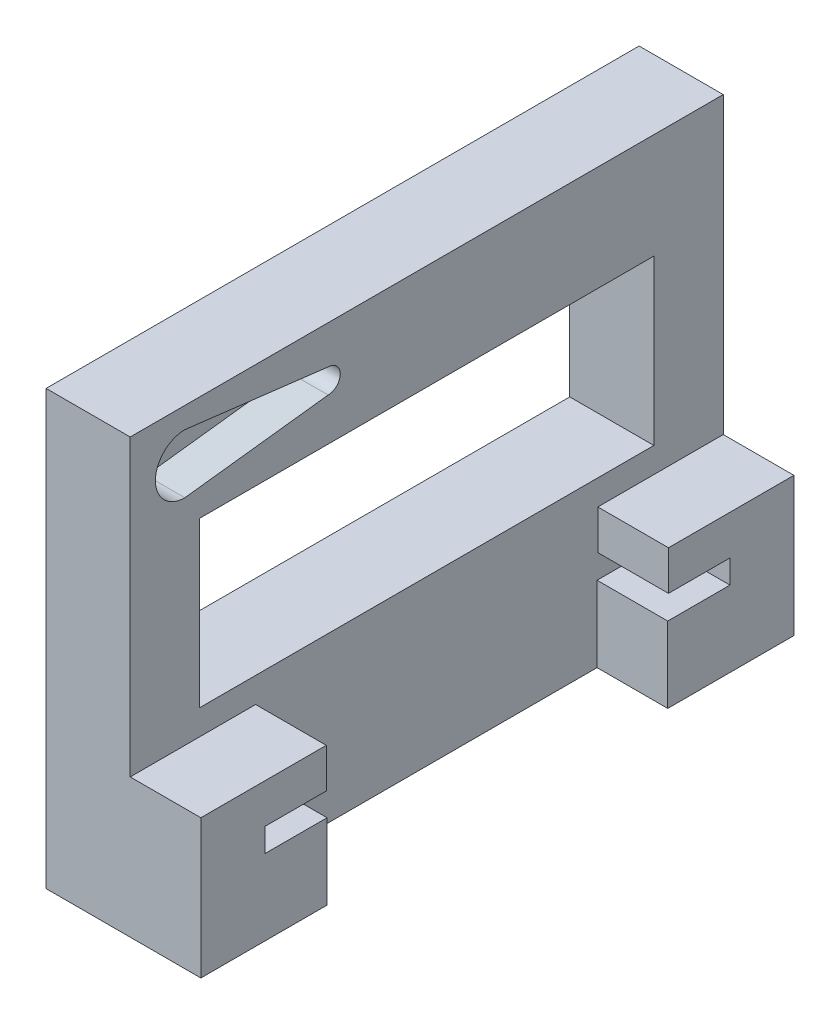
ISO-10303-21;
HEADER;
FILE_DESCRIPTION(('STEP AP214'),'2;1');
FILE_NAME('part.step','',(''),(''),'','','');
FILE_SCHEMA(('AUTOMOTIVE_DESIGN { 1 0 10303 214 1 1 1 1 }'));
ENDSEC;
DATA;
#1=APPLICATION_CONTEXT('core data for automotive mechanical design processes');
#2=APPLICATION_PROTOCOL_DEFINITION('international standard','automotive_design',2000,#1);
#3=PRODUCT_CONTEXT('',#1,'mechanical');
#4=PRODUCT('Part','Part','',(#3));
#5=PRODUCT_RELATED_PRODUCT_CATEGORY('part','',(#4));
#6=PRODUCT_DEFINITION_FORMATION('','',#4);
#7=PRODUCT_DEFINITION_CONTEXT('part definition',#1,'design');
#8=PRODUCT_DEFINITION('design','',#6,#7);
#9=PRODUCT_DEFINITION_SHAPE('','',#8);
#10=(LENGTH_UNIT() NAMED_UNIT(*) SI_UNIT(.MILLI.,.METRE.));
#11=(NAMED_UNIT(*) PLANE_ANGLE_UNIT() SI_UNIT($,.RADIAN.));
#12=(NAMED_UNIT(*) SI_UNIT($,.STERADIAN.) SOLID_ANGLE_UNIT());
#13=UNCERTAINTY_MEASURE_WITH_UNIT(LENGTH_MEASURE(1.E-05),#10,'distance_accuracy_value','');
#14=(GEOMETRIC_REPRESENTATION_CONTEXT(3) GLOBAL_UNCERTAINTY_ASSIGNED_CONTEXT((#13)) GLOBAL_UNIT_ASSIGNED_CONTEXT((#10,
#11,#12)) REPRESENTATION_CONTEXT('',''));
#15=CARTESIAN_POINT('',(0.,0.,0.));
#16=DIRECTION('',(0.,0.,1.));
#17=DIRECTION('',(1.,0.,0.));
#18=AXIS2_PLACEMENT_3D('',#15,#16,#17);
#19=CARTESIAN_POINT('',(8.4,9.,0.));
#20=DIRECTION('',(1.,0.,0.));
#21=DIRECTION('',(0.,0.,-1.));
#22=AXIS2_PLACEMENT_3D('',#19,#20,#21);
#23=PLANE('',#22);
#24=DIRECTION('',(0.,0.,-1.));
#25=VECTOR('',#24,1.);
#26=CARTESIAN_POINT('',(8.4,16.5,15.));
#27=LINE('',#26,#25);
#28=CARTESIAN_POINT('',(8.4,16.5,15.));
#29=VERTEX_POINT('',#28);
#30=CARTESIAN_POINT('',(8.4,16.5,0.0899999999999981));
#31=VERTEX_POINT('',#30);
#32=EDGE_CURVE('E317',#29,#31,#27,.T.);
#33=ORIENTED_EDGE('',*,*,#32,.F.);
#34=DIRECTION('',(0.,-1.,0.));
#35=VECTOR('',#34,1.);
#36=CARTESIAN_POINT('',(8.4,9.,15.));
#37=LINE('',#36,#35);
#38=CARTESIAN_POINT('',(8.4,0.,15.));
#39=VERTEX_POINT('',#38);
#40=EDGE_CURVE('E470',#29,#39,#37,.T.);
#41=ORIENTED_EDGE('',*,*,#40,.T.);
#42=DIRECTION('',(0.,0.,1.));
#43=VECTOR('',#42,1.);
#44=CARTESIAN_POINT('',(8.4,0.,0.));
#45=LINE('',#44,#43);
#46=CARTESIAN_POINT('',(8.4,0.,0.));
#47=VERTEX_POINT('',#46);
#48=EDGE_CURVE('E462',#47,#39,#45,.T.);
#49=ORIENTED_EDGE('',*,*,#48,.F.);
#50=DIRECTION('',(0.,1.,0.));
#51=VECTOR('',#50,1.);
#52=CARTESIAN_POINT('',(8.4,-31.4,0.));
#53=LINE('',#52,#51);
#54=CARTESIAN_POINT('',(8.4,9.,0.));
#55=VERTEX_POINT('',#54);
#56=EDGE_CURVE('E444',#47,#55,#53,.T.);
#57=ORIENTED_EDGE('',*,*,#56,.T.);
#58=DIRECTION('',(0.,0.,-1.));
#59=VECTOR('',#58,1.);
#60=CARTESIAN_POINT('',(8.4,9.,7.4));
#61=LINE('',#60,#59);
#62=CARTESIAN_POINT('',(8.4,9.,7.4));
#63=VERTEX_POINT('',#62);
#64=EDGE_CURVE('E379',#63,#55,#61,.T.);
#65=ORIENTED_EDGE('',*,*,#64,.F.);
#66=DIRECTION('',(0.,-1.,0.));
#67=VECTOR('',#66,1.);
#68=CARTESIAN_POINT('',(8.4,11.8,7.4));
#69=LINE('',#68,#67);
#70=CARTESIAN_POINT('',(8.4,11.8,7.4));
#71=VERTEX_POINT('',#70);
#72=EDGE_CURVE('E374',#71,#63,#69,.T.);
#73=ORIENTED_EDGE('',*,*,#72,.F.);
#74=DIRECTION('',(0.,0.,1.));
#75=VECTOR('',#74,1.);
#76=CARTESIAN_POINT('',(8.4,11.8,7.4));
#77=LINE('',#76,#75);
#78=CARTESIAN_POINT('',(8.4,11.8,0.0899999999999986));
#79=VERTEX_POINT('',#78);
#80=EDGE_CURVE('E341',#79,#71,#77,.T.);
#81=ORIENTED_EDGE('',*,*,#80,.F.);
#82=DIRECTION('',(0.,-1.,0.));
#83=VECTOR('',#82,1.);
#84=CARTESIAN_POINT('',(8.4,11.8,0.0899999999999986));
#85=LINE('',#84,#83);
#86=EDGE_CURVE('E347',#31,#79,#85,.T.);
#87=ORIENTED_EDGE('',*,*,#86,.F.);
#88=EDGE_LOOP('',(#33,#41,#49,#57,#65,#73,#81,#87));
#89=FACE_BOUND('',#88,.T.);
#90=ADVANCED_FACE('F45',(#89),#23,.T.);
#91=CARTESIAN_POINT('',(0.,51.5,0.));
#92=DIRECTION('',(0.,1.,0.));
#93=DIRECTION('',(0.,0.,1.));
#94=AXIS2_PLACEMENT_3D('',#91,#92,#93);
#95=PLANE('',#94);
#96=DIRECTION('',(1.,0.,0.));
#97=VECTOR('',#96,1.);
#98=CARTESIAN_POINT('',(-10.,51.5,15.));
#99=LINE('',#98,#97);
#100=CARTESIAN_POINT('',(-10.,51.5,15.));
#101=VERTEX_POINT('',#100);
#102=CARTESIAN_POINT('',(0.,51.5,15.));
#103=VERTEX_POINT('',#102);
#104=EDGE_CURVE('E419',#101,#103,#99,.T.);
#105=ORIENTED_EDGE('',*,*,#104,.T.);
#106=DIRECTION('',(0.,0.,1.));
#107=VECTOR('',#106,1.);
#108=CARTESIAN_POINT('',(0.,51.5,15.));
#109=LINE('',#108,#107);
#110=CARTESIAN_POINT('',(0.,51.5,-55.5));
#111=VERTEX_POINT('',#110);
#112=EDGE_CURVE('E325',#111,#103,#109,.T.);
#113=ORIENTED_EDGE('',*,*,#112,.F.);
#114=DIRECTION('',(-1.,0.,0.));
#115=VECTOR('',#114,1.);
#116=CARTESIAN_POINT('',(-10.,51.5,-55.5));
#117=LINE('',#116,#115);
#118=CARTESIAN_POINT('',(-10.,51.5,-55.5));
#119=VERTEX_POINT('',#118);
#120=EDGE_CURVE('E423',#111,#119,#117,.T.);
#121=ORIENTED_EDGE('',*,*,#120,.T.);
#122=DIRECTION('',(0.,0.,1.));
#123=VECTOR('',#122,1.);
#124=CARTESIAN_POINT('',(-10.,51.5,-55.5));
#125=LINE('',#124,#123);
#126=EDGE_CURVE('E400',#119,#101,#125,.T.);
#127=ORIENTED_EDGE('',*,*,#126,.T.);
#128=EDGE_LOOP('',(#105,#113,#121,#127));
#129=FACE_BOUND('',#128,.T.);
#130=ADVANCED_FACE('F522',(#129),#95,.T.);
#131=CARTESIAN_POINT('',(0.,9.,-55.5));
#132=DIRECTION('',(0.,0.,1.));
#133=DIRECTION('',(1.,0.,0.));
#134=AXIS2_PLACEMENT_3D('',#131,#132,#133);
#135=PLANE('',#134);
#136=DIRECTION('',(0.,1.,0.));
#137=VECTOR('',#136,1.);
#138=CARTESIAN_POINT('',(0.,51.5,-55.5));
#139=LINE('',#138,#137);
#140=CARTESIAN_POINT('',(0.,16.5,-55.5));
#141=VERTEX_POINT('',#140);
#142=EDGE_CURVE('E322',#141,#111,#139,.T.);
#143=ORIENTED_EDGE('',*,*,#142,.F.);
#144=DIRECTION('',(1.,0.,0.));
#145=VECTOR('',#144,1.);
#146=CARTESIAN_POINT('',(0.,16.5,-55.5));
#147=LINE('',#146,#145);
#148=CARTESIAN_POINT('',(8.4,16.5,-55.5));
#149=VERTEX_POINT('',#148);
#150=EDGE_CURVE('E331',#141,#149,#147,.T.);
#151=ORIENTED_EDGE('',*,*,#150,.T.);
#152=DIRECTION('',(0.,-1.,0.));
#153=VECTOR('',#152,1.);
#154=CARTESIAN_POINT('',(8.4,9.,-55.5));
#155=LINE('',#154,#153);
#156=CARTESIAN_POINT('',(8.4,0.,-55.5));
#157=VERTEX_POINT('',#156);
#158=EDGE_CURVE('E467',#149,#157,#155,.T.);
#159=ORIENTED_EDGE('',*,*,#158,.T.);
#160=DIRECTION('',(-1.,0.,0.));
#161=VECTOR('',#160,1.);
#162=CARTESIAN_POINT('',(0.,0.,-55.5));
#163=LINE('',#162,#161);
#164=CARTESIAN_POINT('',(-10.,0.,-55.5));
#165=VERTEX_POINT('',#164);
#166=EDGE_CURVE('E439',#157,#165,#163,.T.);
#167=ORIENTED_EDGE('',*,*,#166,.T.);
#168=DIRECTION('',(0.,-1.,0.));
#169=VECTOR('',#168,1.);
#170=CARTESIAN_POINT('',(-10.,9.,-55.5));
#171=LINE('',#170,#169);
#172=EDGE_CURVE('E476',#119,#165,#171,.T.);
#173=ORIENTED_EDGE('',*,*,#172,.F.);
#174=ORIENTED_EDGE('',*,*,#120,.F.);
#175=EDGE_LOOP('',(#143,#151,#159,#167,#173,#174));
#176=FACE_BOUND('',#175,.T.);
#177=ADVANCED_FACE('F47',(#176),#135,.F.);
#178=CARTESIAN_POINT('',(-9.99999999999999,9.,0.));
#179=DIRECTION('',(1.,0.,0.));
#180=DIRECTION('',(0.,0.,-1.));
#181=AXIS2_PLACEMENT_3D('',#178,#179,#180);
#182=PLANE('',#181);
#183=DIRECTION('',(0.,0.,1.));
#184=VECTOR('',#183,1.);
#185=CARTESIAN_POINT('',(-10.,38.9972,6.75000000000001));
#186=LINE('',#185,#184);
#187=CARTESIAN_POINT('',(-10.,38.9972,-47.25));
#188=VERTEX_POINT('',#187);
#189=CARTESIAN_POINT('',(-10.,38.9972,6.75000000000001));
#190=VERTEX_POINT('',#189);
#191=EDGE_CURVE('E228',#188,#190,#186,.T.);
#192=ORIENTED_EDGE('',*,*,#191,.T.);
#193=DIRECTION('',(0.,-1.,0.));
#194=VECTOR('',#193,1.);
#195=CARTESIAN_POINT('',(-10.,38.9972,6.75000000000001));
#196=LINE('',#195,#194);
#197=CARTESIAN_POINT('',(-10.,19.5,6.75));
#198=VERTEX_POINT('',#197);
#199=EDGE_CURVE('E221',#190,#198,#196,.T.);
#200=ORIENTED_EDGE('',*,*,#199,.T.);
#201=DIRECTION('',(0.,0.,-1.));
#202=VECTOR('',#201,1.);
#203=CARTESIAN_POINT('',(-10.,19.5,6.75));
#204=LINE('',#203,#202);
#205=CARTESIAN_POINT('',(-10.,19.5,-47.25));
#206=VERTEX_POINT('',#205);
#207=EDGE_CURVE('E231',#198,#206,#204,.T.);
#208=ORIENTED_EDGE('',*,*,#207,.T.);
#209=DIRECTION('',(0.,1.,0.));
#210=VECTOR('',#209,1.);
#211=CARTESIAN_POINT('',(-10.,38.9972,-47.25));
#212=LINE('',#211,#210);
#213=EDGE_CURVE('E61',#206,#188,#212,.T.);
#214=ORIENTED_EDGE('',*,*,#213,.T.);
#215=EDGE_LOOP('',(#192,#200,#208,#214));
#216=FACE_BOUND('',#215,.T.);
#217=DIRECTION('',(0.,0.,1.));
#218=VECTOR('',#217,1.);
#219=CARTESIAN_POINT('',(-9.99999999999999,0.,0.));
#220=LINE('',#219,#218);
#221=CARTESIAN_POINT('',(-9.99999999999999,0.,15.));
#222=VERTEX_POINT('',#221);
#223=EDGE_CURVE('E454',#165,#222,#220,.T.);
#224=ORIENTED_EDGE('',*,*,#223,.T.);
#225=DIRECTION('',(0.,-1.,0.));
#226=VECTOR('',#225,1.);
#227=CARTESIAN_POINT('',(-9.99999999999999,9.,15.));
#228=LINE('',#227,#226);
#229=EDGE_CURVE('E473',#101,#222,#228,.T.);
#230=ORIENTED_EDGE('',*,*,#229,.F.);
#231=ORIENTED_EDGE('',*,*,#126,.F.);
#232=ORIENTED_EDGE('',*,*,#172,.T.);
#233=EDGE_LOOP('',(#224,#230,#231,#232));
#234=FACE_BOUND('',#233,.T.);
#235=ADVANCED_FACE('F236',(#216,#234),#182,.F.);
#236=CARTESIAN_POINT('',(0.,9.,15.));
#237=DIRECTION('',(0.,0.,1.));
#238=DIRECTION('',(1.,0.,0.));
#239=AXIS2_PLACEMENT_3D('',#236,#237,#238);
#240=PLANE('',#239);
#241=DIRECTION('',(1.,0.,0.));
#242=VECTOR('',#241,1.);
#243=CARTESIAN_POINT('',(0.,16.5,15.));
#244=LINE('',#243,#242);
#245=CARTESIAN_POINT('',(0.,16.5,15.));
#246=VERTEX_POINT('',#245);
#247=EDGE_CURVE('E328',#246,#29,#244,.T.);
#248=ORIENTED_EDGE('',*,*,#247,.F.);
#249=DIRECTION('',(0.,-1.,0.));
#250=VECTOR('',#249,1.);
#251=CARTESIAN_POINT('',(0.,51.5,15.));
#252=LINE('',#251,#250);
#253=EDGE_CURVE('E312',#103,#246,#252,.T.);
#254=ORIENTED_EDGE('',*,*,#253,.F.);
#255=ORIENTED_EDGE('',*,*,#104,.F.);
#256=ORIENTED_EDGE('',*,*,#229,.T.);
#257=DIRECTION('',(-1.,0.,0.));
#258=VECTOR('',#257,1.);
#259=CARTESIAN_POINT('',(0.,0.,15.));
#260=LINE('',#259,#258);
#261=EDGE_CURVE('E458',#39,#222,#260,.T.);
#262=ORIENTED_EDGE('',*,*,#261,.F.);
#263=ORIENTED_EDGE('',*,*,#40,.F.);
#264=EDGE_LOOP('',(#248,#254,#255,#256,#262,#263));
#265=FACE_BOUND('',#264,.T.);
#266=ADVANCED_FACE('F527',(#265),#240,.T.);
#267=CARTESIAN_POINT('',(8.4,16.5,-40.59));
#268=VERTEX_POINT('',#267);
#269=EDGE_CURVE('E302',#268,#149,#27,.T.);
#270=ORIENTED_EDGE('',*,*,#269,.F.);
#271=DIRECTION('',(0.,1.,0.));
#272=VECTOR('',#271,1.);
#273=CARTESIAN_POINT('',(8.4,11.8,-40.59));
#274=LINE('',#273,#272);
#275=CARTESIAN_POINT('',(8.4,11.8,-40.59));
#276=VERTEX_POINT('',#275);
#277=EDGE_CURVE('E390',#276,#268,#274,.T.);
#278=ORIENTED_EDGE('',*,*,#277,.F.);
#279=DIRECTION('',(0.,0.,1.));
#280=VECTOR('',#279,1.);
#281=CARTESIAN_POINT('',(8.4,11.8,-40.59));
#282=LINE('',#281,#280);
#283=CARTESIAN_POINT('',(8.4,11.8,-47.9));
#284=VERTEX_POINT('',#283);
#285=EDGE_CURVE('E386',#284,#276,#282,.T.);
#286=ORIENTED_EDGE('',*,*,#285,.F.);
#287=DIRECTION('',(0.,1.,0.));
#288=VECTOR('',#287,1.);
#289=CARTESIAN_POINT('',(8.4,11.8,-47.9));
#290=LINE('',#289,#288);
#291=CARTESIAN_POINT('',(8.4,9.,-47.9));
#292=VERTEX_POINT('',#291);
#293=EDGE_CURVE('E382',#292,#284,#290,.T.);
#294=ORIENTED_EDGE('',*,*,#293,.F.);
#295=CARTESIAN_POINT('',(8.4,9.,-40.5));
#296=VERTEX_POINT('',#295);
#297=EDGE_CURVE('E378',#296,#292,#61,.T.);
#298=ORIENTED_EDGE('',*,*,#297,.F.);
#299=DIRECTION('',(0.,1.,0.));
#300=VECTOR('',#299,1.);
#301=CARTESIAN_POINT('',(8.4,-31.4,-40.5));
#302=LINE('',#301,#300);
#303=CARTESIAN_POINT('',(8.4,0.,-40.5));
#304=VERTEX_POINT('',#303);
#305=EDGE_CURVE('E440',#304,#296,#302,.T.);
#306=ORIENTED_EDGE('',*,*,#305,.F.);
#307=EDGE_CURVE('E463',#157,#304,#45,.T.);
#308=ORIENTED_EDGE('',*,*,#307,.F.);
#309=ORIENTED_EDGE('',*,*,#158,.F.);
#310=EDGE_LOOP('',(#270,#278,#286,#294,#298,#306,#308,#309));
#311=FACE_BOUND('',#310,.T.);
#312=ADVANCED_FACE('F500',(#311),#23,.T.);
#313=CARTESIAN_POINT('',(0.,0.,0.));
#314=DIRECTION('',(0.,1.,0.));
#315=DIRECTION('',(0.,0.,1.));
#316=AXIS2_PLACEMENT_3D('',#313,#314,#315);
#317=PLANE('',#316);
#318=ORIENTED_EDGE('',*,*,#307,.T.);
#319=DIRECTION('',(-1.,0.,0.));
#320=VECTOR('',#319,1.);
#321=CARTESIAN_POINT('',(0.,0.,-40.5));
#322=LINE('',#321,#320);
#323=CARTESIAN_POINT('',(0.,0.,-40.5));
#324=VERTEX_POINT('',#323);
#325=EDGE_CURVE('E54',#304,#324,#322,.T.);
#326=ORIENTED_EDGE('',*,*,#325,.T.);
#327=DIRECTION('',(0.,0.,1.));
#328=VECTOR('',#327,1.);
#329=CARTESIAN_POINT('',(0.,0.,0.));
#330=LINE('',#329,#328);
#331=CARTESIAN_POINT('',(0.,0.,0.));
#332=VERTEX_POINT('',#331);
#333=EDGE_CURVE('E484',#324,#332,#330,.T.);
#334=ORIENTED_EDGE('',*,*,#333,.T.);
#335=DIRECTION('',(1.,0.,0.));
#336=VECTOR('',#335,1.);
#337=CARTESIAN_POINT('',(0.,0.,0.));
#338=LINE('',#337,#336);
#339=EDGE_CURVE('E480',#332,#47,#338,.T.);
#340=ORIENTED_EDGE('',*,*,#339,.T.);
#341=ORIENTED_EDGE('',*,*,#48,.T.);
#342=ORIENTED_EDGE('',*,*,#261,.T.);
#343=ORIENTED_EDGE('',*,*,#223,.F.);
#344=ORIENTED_EDGE('',*,*,#166,.F.);
#345=EDGE_LOOP('',(#318,#326,#334,#340,#341,#342,#343,#344));
#346=FACE_BOUND('',#345,.T.);
#347=ADVANCED_FACE('F490',(#346),#317,.F.);
#348=CARTESIAN_POINT('',(0.,-31.4,0.));
#349=DIRECTION('',(-1.,0.,0.));
#350=DIRECTION('',(0.,0.,1.));
#351=AXIS2_PLACEMENT_3D('',#348,#349,#350);
#352=PLANE('',#351);
#353=DIRECTION('',(0.,0.,-1.));
#354=VECTOR('',#353,1.);
#355=CARTESIAN_POINT('',(0.,19.5,6.75));
#356=LINE('',#355,#354);
#357=CARTESIAN_POINT('',(0.,19.5,6.75));
#358=VERTEX_POINT('',#357);
#359=CARTESIAN_POINT('',(0.,19.5,-47.25));
#360=VERTEX_POINT('',#359);
#361=EDGE_CURVE('E253',#358,#360,#356,.T.);
#362=ORIENTED_EDGE('',*,*,#361,.F.);
#363=DIRECTION('',(0.,-1.,0.));
#364=VECTOR('',#363,1.);
#365=CARTESIAN_POINT('',(0.,38.9972,6.75000000000001));
#366=LINE('',#365,#364);
#367=CARTESIAN_POINT('',(0.,38.9972,6.75000000000001));
#368=VERTEX_POINT('',#367);
#369=EDGE_CURVE('E69',#368,#358,#366,.T.);
#370=ORIENTED_EDGE('',*,*,#369,.F.);
#371=DIRECTION('',(0.,0.,1.));
#372=VECTOR('',#371,1.);
#373=CARTESIAN_POINT('',(0.,38.9972,6.75000000000001));
#374=LINE('',#373,#372);
#375=CARTESIAN_POINT('',(0.,38.9972,-47.25));
#376=VERTEX_POINT('',#375);
#377=EDGE_CURVE('E240',#376,#368,#374,.T.);
#378=ORIENTED_EDGE('',*,*,#377,.F.);
#379=DIRECTION('',(0.,1.,0.));
#380=VECTOR('',#379,1.);
#381=CARTESIAN_POINT('',(0.,38.9972,-47.25));
#382=LINE('',#381,#380);
#383=EDGE_CURVE('E244',#360,#376,#382,.T.);
#384=ORIENTED_EDGE('',*,*,#383,.F.);
#385=EDGE_LOOP('',(#362,#370,#378,#384));
#386=FACE_BOUND('',#385,.T.);
#387=DIRECTION('',(0.,0.119966714313366,-0.992777914468717));
#388=VECTOR('',#387,1.);
#389=CARTESIAN_POINT('',(0.,41.9972,8.5));
#390=LINE('',#389,#388);
#391=CARTESIAN_POINT('',(0.,41.9972,8.5));
#392=VERTEX_POINT('',#391);
#393=CARTESIAN_POINT('',(0.,44.0546,-8.5259));
#394=VERTEX_POINT('',#393);
#395=EDGE_CURVE('E288',#392,#394,#390,.T.);
#396=ORIENTED_EDGE('',*,*,#395,.F.);
#397=CARTESIAN_POINT('',(0.,45.5,8.5));
#398=DIRECTION('',(1.,0.,0.));
#399=DIRECTION('',(0.,0.,-1.));
#400=AXIS2_PLACEMENT_3D('',#397,#398,#399);
#401=CIRCLE('',#400,3.5028);
#402=CARTESIAN_POINT('',(0.,49.0028,8.5));
#403=VERTEX_POINT('',#402);
#404=EDGE_CURVE('E262',#403,#392,#401,.T.);
#405=ORIENTED_EDGE('',*,*,#404,.F.);
#406=DIRECTION('',(0.,0.119966714313366,0.992777914468717));
#407=VECTOR('',#406,1.);
#408=CARTESIAN_POINT('',(0.,49.0028,8.5));
#409=LINE('',#408,#407);
#410=CARTESIAN_POINT('',(0.,46.9454,-8.5259));
#411=VERTEX_POINT('',#410);
#412=EDGE_CURVE('E273',#411,#403,#409,.T.);
#413=ORIENTED_EDGE('',*,*,#412,.F.);
#414=CARTESIAN_POINT('',(0.,45.5,-8.5259));
#415=DIRECTION('',(1.,0.,0.));
#416=DIRECTION('',(0.,0.,-1.));
#417=AXIS2_PLACEMENT_3D('',#414,#415,#416);
#418=CIRCLE('',#417,1.4454);
#419=EDGE_CURVE('E292',#394,#411,#418,.T.);
#420=ORIENTED_EDGE('',*,*,#419,.F.);
#421=EDGE_LOOP('',(#396,#405,#413,#420));
#422=FACE_BOUND('',#421,.T.);
#423=DIRECTION('',(0.,1.,0.));
#424=VECTOR('',#423,1.);
#425=CARTESIAN_POINT('',(0.,11.8,-40.59));
#426=LINE('',#425,#424);
#427=CARTESIAN_POINT('',(0.,11.8,-40.59));
#428=VERTEX_POINT('',#427);
#429=CARTESIAN_POINT('',(0.,16.5,-40.59));
#430=VERTEX_POINT('',#429);
#431=EDGE_CURVE('E363',#428,#430,#426,.T.);
#432=ORIENTED_EDGE('',*,*,#431,.T.);
#433=DIRECTION('',(0.,0.,-1.));
#434=VECTOR('',#433,1.);
#435=CARTESIAN_POINT('',(0.,16.5,15.));
#436=LINE('',#435,#434);
#437=EDGE_CURVE('E316',#430,#141,#436,.T.);
#438=ORIENTED_EDGE('',*,*,#437,.T.);
#439=ORIENTED_EDGE('',*,*,#142,.T.);
#440=ORIENTED_EDGE('',*,*,#112,.T.);
#441=ORIENTED_EDGE('',*,*,#253,.T.);
#442=CARTESIAN_POINT('',(0.,16.5,0.0899999999999998));
#443=VERTEX_POINT('',#442);
#444=EDGE_CURVE('E318',#246,#443,#436,.T.);
#445=ORIENTED_EDGE('',*,*,#444,.T.);
#446=DIRECTION('',(0.,-1.,0.));
#447=VECTOR('',#446,1.);
#448=CARTESIAN_POINT('',(0.,11.8,0.0899999999999998));
#449=LINE('',#448,#447);
#450=CARTESIAN_POINT('',(0.,11.8,0.0899999999999998));
#451=VERTEX_POINT('',#450);
#452=EDGE_CURVE('E367',#443,#451,#449,.T.);
#453=ORIENTED_EDGE('',*,*,#452,.T.);
#454=DIRECTION('',(0.,0.,1.));
#455=VECTOR('',#454,1.);
#456=CARTESIAN_POINT('',(0.,11.8,7.4));
#457=LINE('',#456,#455);
#458=CARTESIAN_POINT('',(0.,11.8,7.4));
#459=VERTEX_POINT('',#458);
#460=EDGE_CURVE('E342',#451,#459,#457,.T.);
#461=ORIENTED_EDGE('',*,*,#460,.T.);
#462=DIRECTION('',(0.,-1.,0.));
#463=VECTOR('',#462,1.);
#464=CARTESIAN_POINT('',(0.,11.8,7.4));
#465=LINE('',#464,#463);
#466=CARTESIAN_POINT('',(0.,9.,7.4));
#467=VERTEX_POINT('',#466);
#468=EDGE_CURVE('E346',#459,#467,#465,.T.);
#469=ORIENTED_EDGE('',*,*,#468,.T.);
#470=DIRECTION('',(0.,0.,-1.));
#471=VECTOR('',#470,1.);
#472=CARTESIAN_POINT('',(0.,9.,7.4));
#473=LINE('',#472,#471);
#474=CARTESIAN_POINT('',(0.,9.,0.));
#475=VERTEX_POINT('',#474);
#476=EDGE_CURVE('E352',#467,#475,#473,.T.);
#477=ORIENTED_EDGE('',*,*,#476,.T.);
#478=DIRECTION('',(0.,1.,0.));
#479=VECTOR('',#478,1.);
#480=CARTESIAN_POINT('',(0.,-31.4,0.));
#481=LINE('',#480,#479);
#482=EDGE_CURVE('E434',#332,#475,#481,.T.);
#483=ORIENTED_EDGE('',*,*,#482,.F.);
#484=ORIENTED_EDGE('',*,*,#333,.F.);
#485=DIRECTION('',(0.,1.,0.));
#486=VECTOR('',#485,1.);
#487=CARTESIAN_POINT('',(0.,-31.4,-40.5));
#488=LINE('',#487,#486);
#489=CARTESIAN_POINT('',(0.,9.,-40.5));
#490=VERTEX_POINT('',#489);
#491=EDGE_CURVE('E435',#324,#490,#488,.T.);
#492=ORIENTED_EDGE('',*,*,#491,.T.);
#493=CARTESIAN_POINT('',(0.,9.,-47.9));
#494=VERTEX_POINT('',#493);
#495=EDGE_CURVE('E351',#490,#494,#473,.T.);
#496=ORIENTED_EDGE('',*,*,#495,.T.);
#497=DIRECTION('',(0.,1.,0.));
#498=VECTOR('',#497,1.);
#499=CARTESIAN_POINT('',(0.,11.8,-47.9));
#500=LINE('',#499,#498);
#501=CARTESIAN_POINT('',(0.,11.8,-47.9));
#502=VERTEX_POINT('',#501);
#503=EDGE_CURVE('E355',#494,#502,#500,.T.);
#504=ORIENTED_EDGE('',*,*,#503,.T.);
#505=DIRECTION('',(0.,0.,1.));
#506=VECTOR('',#505,1.);
#507=CARTESIAN_POINT('',(0.,11.8,-40.59));
#508=LINE('',#507,#506);
#509=EDGE_CURVE('E359',#502,#428,#508,.T.);
#510=ORIENTED_EDGE('',*,*,#509,.T.);
#511=EDGE_LOOP('',(#432,#438,#439,#440,#441,#445,#453,#461,#469,#477,#483,#484,#492,#496,#504,#510));
#512=FACE_BOUND('',#511,.T.);
#513=ADVANCED_FACE('F519',(#386,#422,#512),#352,.F.);
#514=CARTESIAN_POINT('',(0.,-31.4,-40.5));
#515=DIRECTION('',(0.,0.,-1.));
#516=DIRECTION('',(-1.,0.,0.));
#517=AXIS2_PLACEMENT_3D('',#514,#515,#516);
#518=PLANE('',#517);
#519=ORIENTED_EDGE('',*,*,#305,.T.);
#520=DIRECTION('',(-1.,0.,0.));
#521=VECTOR('',#520,1.);
#522=CARTESIAN_POINT('',(0.,9.,-40.5));
#523=LINE('',#522,#521);
#524=EDGE_CURVE('E430',#296,#490,#523,.T.);
#525=ORIENTED_EDGE('',*,*,#524,.T.);
#526=ORIENTED_EDGE('',*,*,#491,.F.);
#527=ORIENTED_EDGE('',*,*,#325,.F.);
#528=EDGE_LOOP('',(#519,#525,#526,#527));
#529=FACE_BOUND('',#528,.T.);
#530=ADVANCED_FACE('F496',(#529),#518,.F.);
#531=CARTESIAN_POINT('',(0.,-31.4,0.));
#532=DIRECTION('',(0.,0.,1.));
#533=DIRECTION('',(1.,0.,0.));
#534=AXIS2_PLACEMENT_3D('',#531,#532,#533);
#535=PLANE('',#534);
#536=ORIENTED_EDGE('',*,*,#482,.T.);
#537=DIRECTION('',(1.,0.,0.));
#538=VECTOR('',#537,1.);
#539=CARTESIAN_POINT('',(0.,9.,0.));
#540=LINE('',#539,#538);
#541=EDGE_CURVE('E426',#475,#55,#540,.T.);
#542=ORIENTED_EDGE('',*,*,#541,.T.);
#543=ORIENTED_EDGE('',*,*,#56,.F.);
#544=ORIENTED_EDGE('',*,*,#339,.F.);
#545=EDGE_LOOP('',(#536,#542,#543,#544));
#546=FACE_BOUND('',#545,.T.);
#547=ADVANCED_FACE('F551',(#546),#535,.F.);
#548=CARTESIAN_POINT('',(0.,9.,7.4));
#549=DIRECTION('',(0.,-1.,0.));
#550=DIRECTION('',(0.,0.,-1.));
#551=AXIS2_PLACEMENT_3D('',#548,#549,#550);
#552=PLANE('',#551);
#553=ORIENTED_EDGE('',*,*,#297,.T.);
#554=DIRECTION('',(1.,0.,0.));
#555=VECTOR('',#554,1.);
#556=CARTESIAN_POINT('',(0.,9.,-47.9));
#557=LINE('',#556,#555);
#558=EDGE_CURVE('E407',#494,#292,#557,.T.);
#559=ORIENTED_EDGE('',*,*,#558,.F.);
#560=ORIENTED_EDGE('',*,*,#495,.F.);
#561=ORIENTED_EDGE('',*,*,#524,.F.);
#562=EDGE_LOOP('',(#553,#559,#560,#561));
#563=FACE_BOUND('',#562,.T.);
#564=ADVANCED_FACE('F552',(#563),#552,.F.);
#565=ORIENTED_EDGE('',*,*,#476,.F.);
#566=DIRECTION('',(1.,0.,0.));
#567=VECTOR('',#566,1.);
#568=CARTESIAN_POINT('',(0.,9.,7.4));
#569=LINE('',#568,#567);
#570=EDGE_CURVE('E411',#467,#63,#569,.T.);
#571=ORIENTED_EDGE('',*,*,#570,.T.);
#572=ORIENTED_EDGE('',*,*,#64,.T.);
#573=ORIENTED_EDGE('',*,*,#541,.F.);
#574=EDGE_LOOP('',(#565,#571,#572,#573));
#575=FACE_BOUND('',#574,.T.);
#576=ADVANCED_FACE('F549',(#575),#552,.F.);
#577=CARTESIAN_POINT('',(0.,11.8,7.4));
#578=DIRECTION('',(0.,1.,0.));
#579=DIRECTION('',(0.,0.,1.));
#580=AXIS2_PLACEMENT_3D('',#577,#578,#579);
#581=PLANE('',#580);
#582=ORIENTED_EDGE('',*,*,#80,.T.);
#583=DIRECTION('',(1.,0.,0.));
#584=VECTOR('',#583,1.);
#585=CARTESIAN_POINT('',(0.,11.8,7.4));
#586=LINE('',#585,#584);
#587=EDGE_CURVE('E370',#459,#71,#586,.T.);
#588=ORIENTED_EDGE('',*,*,#587,.F.);
#589=ORIENTED_EDGE('',*,*,#460,.F.);
#590=DIRECTION('',(1.,0.,0.));
#591=VECTOR('',#590,1.);
#592=CARTESIAN_POINT('',(0.,11.8,0.0899999999999998));
#593=LINE('',#592,#591);
#594=EDGE_CURVE('E396',#451,#79,#593,.T.);
#595=ORIENTED_EDGE('',*,*,#594,.T.);
#596=EDGE_LOOP('',(#582,#588,#589,#595));
#597=FACE_BOUND('',#596,.T.);
#598=ADVANCED_FACE('F539',(#597),#581,.F.);
#599=CARTESIAN_POINT('',(0.,11.8,0.0899999999999998));
#600=DIRECTION('',(0.,0.,1.));
#601=DIRECTION('',(1.,0.,0.));
#602=AXIS2_PLACEMENT_3D('',#599,#600,#601);
#603=PLANE('',#602);
#604=ORIENTED_EDGE('',*,*,#452,.F.);
#605=DIRECTION('',(1.,0.,0.));
#606=VECTOR('',#605,1.);
#607=CARTESIAN_POINT('',(0.,16.5,0.0899999999999998));
#608=LINE('',#607,#606);
#609=EDGE_CURVE('E335',#443,#31,#608,.T.);
#610=ORIENTED_EDGE('',*,*,#609,.T.);
#611=ORIENTED_EDGE('',*,*,#86,.T.);
#612=ORIENTED_EDGE('',*,*,#594,.F.);
#613=EDGE_LOOP('',(#604,#610,#611,#612));
#614=FACE_BOUND('',#613,.T.);
#615=ADVANCED_FACE('F534',(#614),#603,.F.);
#616=CARTESIAN_POINT('',(0.,11.8,-40.59));
#617=DIRECTION('',(0.,0.,-1.));
#618=DIRECTION('',(-1.,0.,0.));
#619=AXIS2_PLACEMENT_3D('',#616,#617,#618);
#620=PLANE('',#619);
#621=ORIENTED_EDGE('',*,*,#277,.T.);
#622=DIRECTION('',(-1.,0.,0.));
#623=VECTOR('',#622,1.);
#624=CARTESIAN_POINT('',(0.,16.5,-40.59));
#625=LINE('',#624,#623);
#626=EDGE_CURVE('E11',#268,#430,#625,.T.);
#627=ORIENTED_EDGE('',*,*,#626,.T.);
#628=ORIENTED_EDGE('',*,*,#431,.F.);
#629=DIRECTION('',(1.,0.,0.));
#630=VECTOR('',#629,1.);
#631=CARTESIAN_POINT('',(0.,11.8,-40.59));
#632=LINE('',#631,#630);
#633=EDGE_CURVE('E401',#428,#276,#632,.T.);
#634=ORIENTED_EDGE('',*,*,#633,.T.);
#635=EDGE_LOOP('',(#621,#627,#628,#634));
#636=FACE_BOUND('',#635,.T.);
#637=ADVANCED_FACE('F629',(#636),#620,.F.);
#638=CARTESIAN_POINT('',(0.,11.8,-40.59));
#639=DIRECTION('',(0.,1.,0.));
#640=DIRECTION('',(0.,0.,1.));
#641=AXIS2_PLACEMENT_3D('',#638,#639,#640);
#642=PLANE('',#641);
#643=ORIENTED_EDGE('',*,*,#285,.T.);
#644=ORIENTED_EDGE('',*,*,#633,.F.);
#645=ORIENTED_EDGE('',*,*,#509,.F.);
#646=DIRECTION('',(1.,0.,0.));
#647=VECTOR('',#646,1.);
#648=CARTESIAN_POINT('',(0.,11.8,-47.9));
#649=LINE('',#648,#647);
#650=EDGE_CURVE('E404',#502,#284,#649,.T.);
#651=ORIENTED_EDGE('',*,*,#650,.T.);
#652=EDGE_LOOP('',(#643,#644,#645,#651));
#653=FACE_BOUND('',#652,.T.);
#654=ADVANCED_FACE('F618',(#653),#642,.F.);
#655=CARTESIAN_POINT('',(0.,11.8,-47.9));
#656=DIRECTION('',(0.,0.,-1.));
#657=DIRECTION('',(-1.,0.,0.));
#658=AXIS2_PLACEMENT_3D('',#655,#656,#657);
#659=PLANE('',#658);
#660=ORIENTED_EDGE('',*,*,#293,.T.);
#661=ORIENTED_EDGE('',*,*,#650,.F.);
#662=ORIENTED_EDGE('',*,*,#503,.F.);
#663=ORIENTED_EDGE('',*,*,#558,.T.);
#664=EDGE_LOOP('',(#660,#661,#662,#663));
#665=FACE_BOUND('',#664,.T.);
#666=ADVANCED_FACE('F568',(#665),#659,.F.);
#667=CARTESIAN_POINT('',(0.,11.8,7.4));
#668=DIRECTION('',(0.,0.,1.));
#669=DIRECTION('',(0.,-1.,0.));
#670=AXIS2_PLACEMENT_3D('',#667,#668,#669);
#671=PLANE('',#670);
#672=ORIENTED_EDGE('',*,*,#72,.T.);
#673=ORIENTED_EDGE('',*,*,#570,.F.);
#674=ORIENTED_EDGE('',*,*,#468,.F.);
#675=ORIENTED_EDGE('',*,*,#587,.T.);
#676=EDGE_LOOP('',(#672,#673,#674,#675));
#677=FACE_BOUND('',#676,.T.);
#678=ADVANCED_FACE('F545',(#677),#671,.F.);
#679=CARTESIAN_POINT('',(0.,16.5,15.));
#680=DIRECTION('',(0.,-1.,0.));
#681=DIRECTION('',(0.,0.,-1.));
#682=AXIS2_PLACEMENT_3D('',#679,#680,#681);
#683=PLANE('',#682);
#684=ORIENTED_EDGE('',*,*,#444,.F.);
#685=ORIENTED_EDGE('',*,*,#247,.T.);
#686=ORIENTED_EDGE('',*,*,#32,.T.);
#687=ORIENTED_EDGE('',*,*,#609,.F.);
#688=EDGE_LOOP('',(#684,#685,#686,#687));
#689=FACE_BOUND('',#688,.T.);
#690=ADVANCED_FACE('F560',(#689),#683,.F.);
#691=ORIENTED_EDGE('',*,*,#269,.T.);
#692=ORIENTED_EDGE('',*,*,#150,.F.);
#693=ORIENTED_EDGE('',*,*,#437,.F.);
#694=ORIENTED_EDGE('',*,*,#626,.F.);
#695=EDGE_LOOP('',(#691,#692,#693,#694));
#696=FACE_BOUND('',#695,.T.);
#697=ADVANCED_FACE('F511',(#696),#683,.F.);
#698=CARTESIAN_POINT('',(-4.6,45.5,8.5));
#699=DIRECTION('',(1.,0.,0.));
#700=DIRECTION('',(0.,0.,-1.));
#701=AXIS2_PLACEMENT_3D('',#698,#699,#700);
#702=CYLINDRICAL_SURFACE('',#701,3.5028);
#703=ORIENTED_EDGE('',*,*,#404,.T.);
#704=DIRECTION('',(1.,0.,0.));
#705=VECTOR('',#704,1.);
#706=CARTESIAN_POINT('',(-4.6,41.9972,8.5));
#707=LINE('',#706,#705);
#708=CARTESIAN_POINT('',(-4.6,41.9972,8.5));
#709=VERTEX_POINT('',#708);
#710=EDGE_CURVE('E285',#709,#392,#707,.T.);
#711=ORIENTED_EDGE('',*,*,#710,.F.);
#712=CARTESIAN_POINT('',(-4.6,45.5,8.5));
#713=DIRECTION('',(1.,0.,0.));
#714=DIRECTION('',(0.,0.,-1.));
#715=AXIS2_PLACEMENT_3D('',#712,#713,#714);
#716=CIRCLE('',#715,3.5028);
#717=CARTESIAN_POINT('',(-4.6,49.0028,8.5));
#718=VERTEX_POINT('',#717);
#719=EDGE_CURVE('E268',#718,#709,#716,.T.);
#720=ORIENTED_EDGE('',*,*,#719,.F.);
#721=DIRECTION('',(1.,0.,0.));
#722=VECTOR('',#721,1.);
#723=CARTESIAN_POINT('',(-4.6,49.0028,8.5));
#724=LINE('',#723,#722);
#725=EDGE_CURVE('E299',#718,#403,#724,.T.);
#726=ORIENTED_EDGE('',*,*,#725,.T.);
#727=EDGE_LOOP('',(#703,#711,#720,#726));
#728=FACE_BOUND('',#727,.T.);
#729=ADVANCED_FACE('F567',(#728),#702,.F.);
#730=CARTESIAN_POINT('',(-4.6,49.0028,8.5));
#731=DIRECTION('',(0.,0.992777914468717,-0.119966714313366));
#732=DIRECTION('',(0.,0.119966714313366,0.992777914468717));
#733=AXIS2_PLACEMENT_3D('',#730,#731,#732);
#734=PLANE('',#733);
#735=ORIENTED_EDGE('',*,*,#412,.T.);
#736=ORIENTED_EDGE('',*,*,#725,.F.);
#737=DIRECTION('',(0.,0.119966714313366,0.992777914468717));
#738=VECTOR('',#737,1.);
#739=CARTESIAN_POINT('',(-4.6,49.0028,8.5));
#740=LINE('',#739,#738);
#741=CARTESIAN_POINT('',(-4.6,46.9454,-8.5259));
#742=VERTEX_POINT('',#741);
#743=EDGE_CURVE('E281',#742,#718,#740,.T.);
#744=ORIENTED_EDGE('',*,*,#743,.F.);
#745=DIRECTION('',(1.,0.,0.));
#746=VECTOR('',#745,1.);
#747=CARTESIAN_POINT('',(-4.6,46.9454,-8.5259));
#748=LINE('',#747,#746);
#749=EDGE_CURVE('E303',#742,#411,#748,.T.);
#750=ORIENTED_EDGE('',*,*,#749,.T.);
#751=EDGE_LOOP('',(#735,#736,#744,#750));
#752=FACE_BOUND('',#751,.T.);
#753=ADVANCED_FACE('F774',(#752),#734,.F.);
#754=CARTESIAN_POINT('',(-4.6,45.5,-8.5259));
#755=DIRECTION('',(1.,0.,0.));
#756=DIRECTION('',(0.,0.,-1.));
#757=AXIS2_PLACEMENT_3D('',#754,#755,#756);
#758=CYLINDRICAL_SURFACE('',#757,1.4454);
#759=ORIENTED_EDGE('',*,*,#419,.T.);
#760=ORIENTED_EDGE('',*,*,#749,.F.);
#761=CARTESIAN_POINT('',(-4.6,45.5,-8.5259));
#762=DIRECTION('',(1.,0.,0.));
#763=DIRECTION('',(0.,0.,-1.));
#764=AXIS2_PLACEMENT_3D('',#761,#762,#763);
#765=CIRCLE('',#764,1.4454);
#766=CARTESIAN_POINT('',(-4.6,44.0546,-8.5259));
#767=VERTEX_POINT('',#766);
#768=EDGE_CURVE('E277',#767,#742,#765,.T.);
#769=ORIENTED_EDGE('',*,*,#768,.F.);
#770=DIRECTION('',(1.,0.,0.));
#771=VECTOR('',#770,1.);
#772=CARTESIAN_POINT('',(-4.6,44.0546,-8.5259));
#773=LINE('',#772,#771);
#774=EDGE_CURVE('E306',#767,#394,#773,.T.);
#775=ORIENTED_EDGE('',*,*,#774,.T.);
#776=EDGE_LOOP('',(#759,#760,#769,#775));
#777=FACE_BOUND('',#776,.T.);
#778=ADVANCED_FACE('F764',(#777),#758,.F.);
#779=CARTESIAN_POINT('',(-4.6,41.9972,8.5));
#780=DIRECTION('',(0.,-0.992777914468717,-0.119966714313366));
#781=DIRECTION('',(0.,0.119966714313366,-0.992777914468717));
#782=AXIS2_PLACEMENT_3D('',#779,#780,#781);
#783=PLANE('',#782);
#784=ORIENTED_EDGE('',*,*,#395,.T.);
#785=ORIENTED_EDGE('',*,*,#774,.F.);
#786=DIRECTION('',(0.,0.119966714313366,-0.992777914468717));
#787=VECTOR('',#786,1.);
#788=CARTESIAN_POINT('',(-4.6,41.9972,8.5));
#789=LINE('',#788,#787);
#790=EDGE_CURVE('E272',#709,#767,#789,.T.);
#791=ORIENTED_EDGE('',*,*,#790,.F.);
#792=ORIENTED_EDGE('',*,*,#710,.T.);
#793=EDGE_LOOP('',(#784,#785,#791,#792));
#794=FACE_BOUND('',#793,.T.);
#795=ADVANCED_FACE('F755',(#794),#783,.F.);
#796=CARTESIAN_POINT('',(-4.6,45.5,8.5));
#797=DIRECTION('',(1.,0.,0.));
#798=DIRECTION('',(0.,0.,-1.));
#799=AXIS2_PLACEMENT_3D('',#796,#797,#798);
#800=PLANE('',#799);
#801=ORIENTED_EDGE('',*,*,#719,.T.);
#802=ORIENTED_EDGE('',*,*,#790,.T.);
#803=ORIENTED_EDGE('',*,*,#768,.T.);
#804=ORIENTED_EDGE('',*,*,#743,.T.);
#805=EDGE_LOOP('',(#801,#802,#803,#804));
#806=FACE_BOUND('',#805,.T.);
#807=ADVANCED_FACE('F712',(#806),#800,.T.);
#808=CARTESIAN_POINT('',(-10.,38.9972,6.75000000000001));
#809=DIRECTION('',(0.,0.,1.));
#810=DIRECTION('',(0.,-1.,0.));
#811=AXIS2_PLACEMENT_3D('',#808,#809,#810);
#812=PLANE('',#811);
#813=ORIENTED_EDGE('',*,*,#369,.T.);
#814=DIRECTION('',(1.,0.,0.));
#815=VECTOR('',#814,1.);
#816=CARTESIAN_POINT('',(-10.,19.5,6.75));
#817=LINE('',#816,#815);
#818=EDGE_CURVE('E217',#198,#358,#817,.T.);
#819=ORIENTED_EDGE('',*,*,#818,.F.);
#820=ORIENTED_EDGE('',*,*,#199,.F.);
#821=DIRECTION('',(1.,0.,0.));
#822=VECTOR('',#821,1.);
#823=CARTESIAN_POINT('',(-10.,38.9972,6.75000000000001));
#824=LINE('',#823,#822);
#825=EDGE_CURVE('E259',#190,#368,#824,.T.);
#826=ORIENTED_EDGE('',*,*,#825,.T.);
#827=EDGE_LOOP('',(#813,#819,#820,#826));
#828=FACE_BOUND('',#827,.T.);
#829=ADVANCED_FACE('F219',(#828),#812,.F.);
#830=CARTESIAN_POINT('',(-10.,38.9972,6.75000000000001));
#831=DIRECTION('',(0.,1.,0.));
#832=DIRECTION('',(0.,0.,1.));
#833=AXIS2_PLACEMENT_3D('',#830,#831,#832);
#834=PLANE('',#833);
#835=ORIENTED_EDGE('',*,*,#377,.T.);
#836=ORIENTED_EDGE('',*,*,#825,.F.);
#837=ORIENTED_EDGE('',*,*,#191,.F.);
#838=DIRECTION('',(1.,0.,0.));
#839=VECTOR('',#838,1.);
#840=CARTESIAN_POINT('',(-10.,38.9972,-47.25));
#841=LINE('',#840,#839);
#842=EDGE_CURVE('E263',#188,#376,#841,.T.);
#843=ORIENTED_EDGE('',*,*,#842,.T.);
#844=EDGE_LOOP('',(#835,#836,#837,#843));
#845=FACE_BOUND('',#844,.T.);
#846=ADVANCED_FACE('F711',(#845),#834,.F.);
#847=CARTESIAN_POINT('',(-10.,38.9972,-47.25));
#848=DIRECTION('',(0.,0.,-1.));
#849=DIRECTION('',(-1.,0.,0.));
#850=AXIS2_PLACEMENT_3D('',#847,#848,#849);
#851=PLANE('',#850);
#852=ORIENTED_EDGE('',*,*,#383,.T.);
#853=ORIENTED_EDGE('',*,*,#842,.F.);
#854=ORIENTED_EDGE('',*,*,#213,.F.);
#855=DIRECTION('',(1.,0.,0.));
#856=VECTOR('',#855,1.);
#857=CARTESIAN_POINT('',(-10.,19.5,-47.25));
#858=LINE('',#857,#856);
#859=EDGE_CURVE('E227',#206,#360,#858,.T.);
#860=ORIENTED_EDGE('',*,*,#859,.T.);
#861=EDGE_LOOP('',(#852,#853,#854,#860));
#862=FACE_BOUND('',#861,.T.);
#863=ADVANCED_FACE('F724',(#862),#851,.F.);
#864=CARTESIAN_POINT('',(-10.,19.5,6.75));
#865=DIRECTION('',(0.,-1.,0.));
#866=DIRECTION('',(0.,0.,-1.));
#867=AXIS2_PLACEMENT_3D('',#864,#865,#866);
#868=PLANE('',#867);
#869=ORIENTED_EDGE('',*,*,#361,.T.);
#870=ORIENTED_EDGE('',*,*,#859,.F.);
#871=ORIENTED_EDGE('',*,*,#207,.F.);
#872=ORIENTED_EDGE('',*,*,#818,.T.);
#873=EDGE_LOOP('',(#869,#870,#871,#872));
#874=FACE_BOUND('',#873,.T.);
#875=ADVANCED_FACE('F232',(#874),#868,.F.);
#876=CLOSED_SHELL('',(#90,#130,#177,#235,#266,#312,#347,#513,#530,#547,#564,#576,#598,#615,#637,
#654,#666,#678,#690,#697,#729,#753,#778,#795,#807,#829,#846,#863,#875));
#877=MANIFOLD_SOLID_BREP('B2',#876);
#878=ADVANCED_BREP_SHAPE_REPRESENTATION('',(#18,#877),#14);
#879=SHAPE_DEFINITION_REPRESENTATION(#9,#878);
ENDSEC;
END-ISO-10303-21;
